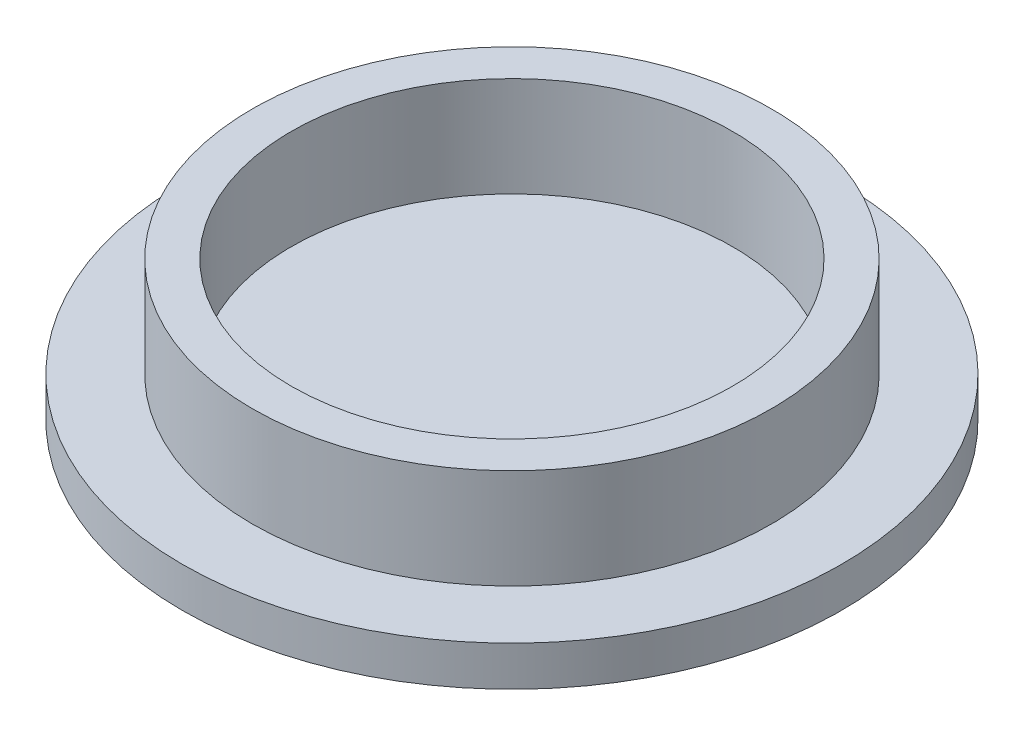
ISO-10303-21;
HEADER;
FILE_DESCRIPTION(('STEP AP214'),'2;1');
FILE_NAME('part.step','',(''),(''),'','','');
FILE_SCHEMA(('AUTOMOTIVE_DESIGN { 1 0 10303 214 1 1 1 1 }'));
ENDSEC;
DATA;
#1=APPLICATION_CONTEXT('core data for automotive mechanical design processes');
#2=APPLICATION_PROTOCOL_DEFINITION('international standard','automotive_design',2000,#1);
#3=PRODUCT_CONTEXT('',#1,'mechanical');
#4=PRODUCT('Part','Part','',(#3));
#5=PRODUCT_RELATED_PRODUCT_CATEGORY('part','',(#4));
#6=PRODUCT_DEFINITION_FORMATION('','',#4);
#7=PRODUCT_DEFINITION_CONTEXT('part definition',#1,'design');
#8=PRODUCT_DEFINITION('design','',#6,#7);
#9=PRODUCT_DEFINITION_SHAPE('','',#8);
#10=(LENGTH_UNIT() NAMED_UNIT(*) SI_UNIT(.MILLI.,.METRE.));
#11=(NAMED_UNIT(*) PLANE_ANGLE_UNIT() SI_UNIT($,.RADIAN.));
#12=(NAMED_UNIT(*) SI_UNIT($,.STERADIAN.) SOLID_ANGLE_UNIT());
#13=UNCERTAINTY_MEASURE_WITH_UNIT(LENGTH_MEASURE(1.E-05),#10,'distance_accuracy_value','');
#14=(GEOMETRIC_REPRESENTATION_CONTEXT(3) GLOBAL_UNCERTAINTY_ASSIGNED_CONTEXT((#13)) GLOBAL_UNIT_ASSIGNED_CONTEXT((#10,
#11,#12)) REPRESENTATION_CONTEXT('',''));
#15=CARTESIAN_POINT('',(0.,0.,0.));
#16=DIRECTION('',(0.,0.,1.));
#17=DIRECTION('',(1.,0.,0.));
#18=AXIS2_PLACEMENT_3D('',#15,#16,#17);
#19=CARTESIAN_POINT('',(0.,2.,0.));
#20=DIRECTION('',(0.,-1.,0.));
#21=DIRECTION('',(0.,0.,-1.));
#22=AXIS2_PLACEMENT_3D('',#19,#20,#21);
#23=CYLINDRICAL_SURFACE('',#22,16.5);
#24=CARTESIAN_POINT('',(0.,2.,0.));
#25=DIRECTION('',(0.,1.,0.));
#26=DIRECTION('',(0.,0.,1.));
#27=AXIS2_PLACEMENT_3D('',#24,#25,#26);
#28=CIRCLE('',#27,16.5);
#29=CARTESIAN_POINT('',(0.,2.,16.5));
#30=VERTEX_POINT('',#29);
#31=EDGE_CURVE('E48',#30,#30,#28,.T.);
#32=ORIENTED_EDGE('',*,*,#31,.F.);
#33=EDGE_LOOP('',(#32));
#34=FACE_BOUND('',#33,.T.);
#35=CARTESIAN_POINT('',(0.,0.,0.));
#36=DIRECTION('',(0.,1.,0.));
#37=DIRECTION('',(0.,0.,1.));
#38=AXIS2_PLACEMENT_3D('',#35,#36,#37);
#39=CIRCLE('',#38,16.5);
#40=CARTESIAN_POINT('',(0.,0.,16.5));
#41=VERTEX_POINT('',#40);
#42=EDGE_CURVE('E53',#41,#41,#39,.T.);
#43=ORIENTED_EDGE('',*,*,#42,.T.);
#44=EDGE_LOOP('',(#43));
#45=FACE_BOUND('',#44,.T.);
#46=ADVANCED_FACE('F41',(#34,#45),#23,.T.);
#47=CARTESIAN_POINT('',(0.,2.,0.));
#48=DIRECTION('',(0.,1.,0.));
#49=DIRECTION('',(0.,0.,1.));
#50=AXIS2_PLACEMENT_3D('',#47,#48,#49);
#51=PLANE('',#50);
#52=CARTESIAN_POINT('',(0.,2.,0.));
#53=DIRECTION('',(0.,1.,0.));
#54=DIRECTION('',(0.,0.,1.));
#55=AXIS2_PLACEMENT_3D('',#52,#53,#54);
#56=CIRCLE('',#55,13.);
#57=CARTESIAN_POINT('',(0.,2.,13.));
#58=VERTEX_POINT('',#57);
#59=EDGE_CURVE('E61',#58,#58,#56,.T.);
#60=ORIENTED_EDGE('',*,*,#59,.F.);
#61=EDGE_LOOP('',(#60));
#62=FACE_BOUND('',#61,.T.);
#63=ORIENTED_EDGE('',*,*,#31,.T.);
#64=EDGE_LOOP('',(#63));
#65=FACE_BOUND('',#64,.T.);
#66=ADVANCED_FACE('F87',(#62,#65),#51,.T.);
#67=CARTESIAN_POINT('',(0.,0.,0.));
#68=DIRECTION('',(0.,1.,0.));
#69=DIRECTION('',(0.,0.,1.));
#70=AXIS2_PLACEMENT_3D('',#67,#68,#69);
#71=PLANE('',#70);
#72=ORIENTED_EDGE('',*,*,#42,.F.);
#73=EDGE_LOOP('',(#72));
#74=FACE_BOUND('',#73,.T.);
#75=ADVANCED_FACE('F78',(#74),#71,.F.);
#76=CARTESIAN_POINT('',(0.,7.,0.));
#77=DIRECTION('',(0.,1.,0.));
#78=DIRECTION('',(0.,0.,1.));
#79=AXIS2_PLACEMENT_3D('',#76,#77,#78);
#80=PLANE('',#79);
#81=CARTESIAN_POINT('',(0.,7.,0.));
#82=DIRECTION('',(0.,1.,0.));
#83=DIRECTION('',(0.,0.,1.));
#84=AXIS2_PLACEMENT_3D('',#81,#82,#83);
#85=CIRCLE('',#84,13.);
#86=CARTESIAN_POINT('',(0.,7.,13.));
#87=VERTEX_POINT('',#86);
#88=EDGE_CURVE('E59',#87,#87,#85,.T.);
#89=ORIENTED_EDGE('',*,*,#88,.T.);
#90=EDGE_LOOP('',(#89));
#91=FACE_BOUND('',#90,.T.);
#92=CARTESIAN_POINT('',(0.,7.,0.));
#93=DIRECTION('',(0.,1.,0.));
#94=DIRECTION('',(0.,0.,1.));
#95=AXIS2_PLACEMENT_3D('',#92,#93,#94);
#96=CIRCLE('',#95,11.05);
#97=CARTESIAN_POINT('',(0.,7.,11.05));
#98=VERTEX_POINT('',#97);
#99=EDGE_CURVE('E65',#98,#98,#96,.T.);
#100=ORIENTED_EDGE('',*,*,#99,.F.);
#101=EDGE_LOOP('',(#100));
#102=FACE_BOUND('',#101,.T.);
#103=ADVANCED_FACE('F75',(#91,#102),#80,.T.);
#104=CARTESIAN_POINT('',(0.,7.,0.));
#105=DIRECTION('',(0.,-1.,0.));
#106=DIRECTION('',(0.,0.,-1.));
#107=AXIS2_PLACEMENT_3D('',#104,#105,#106);
#108=CYLINDRICAL_SURFACE('',#107,13.);
#109=ORIENTED_EDGE('',*,*,#88,.F.);
#110=EDGE_LOOP('',(#109));
#111=FACE_BOUND('',#110,.T.);
#112=ORIENTED_EDGE('',*,*,#59,.T.);
#113=EDGE_LOOP('',(#112));
#114=FACE_BOUND('',#113,.T.);
#115=ADVANCED_FACE('F77',(#111,#114),#108,.T.);
#116=CARTESIAN_POINT('',(0.,7.,0.));
#117=DIRECTION('',(0.,-1.,0.));
#118=DIRECTION('',(0.,0.,-1.));
#119=AXIS2_PLACEMENT_3D('',#116,#117,#118);
#120=CYLINDRICAL_SURFACE('',#119,11.05);
#121=ORIENTED_EDGE('',*,*,#99,.T.);
#122=EDGE_LOOP('',(#121));
#123=FACE_BOUND('',#122,.T.);
#124=CARTESIAN_POINT('',(0.,2.,0.));
#125=DIRECTION('',(0.,1.,0.));
#126=DIRECTION('',(0.,0.,1.));
#127=AXIS2_PLACEMENT_3D('',#124,#125,#126);
#128=CIRCLE('',#127,11.05);
#129=CARTESIAN_POINT('',(0.,2.,11.05));
#130=VERTEX_POINT('',#129);
#131=EDGE_CURVE('E10',#130,#130,#128,.F.);
#132=ORIENTED_EDGE('',*,*,#131,.T.);
#133=EDGE_LOOP('',(#132));
#134=FACE_BOUND('',#133,.T.);
#135=ADVANCED_FACE('F73',(#123,#134),#120,.F.);
#136=ORIENTED_EDGE('',*,*,#131,.F.);
#137=EDGE_LOOP('',(#136));
#138=FACE_BOUND('',#137,.T.);
#139=ADVANCED_FACE('F97',(#138),#51,.T.);
#140=CLOSED_SHELL('',(#46,#66,#75,#103,#115,#135,#139));
#141=MANIFOLD_SOLID_BREP('B2',#140);
#142=ADVANCED_BREP_SHAPE_REPRESENTATION('',(#18,#141),#14);
#143=SHAPE_DEFINITION_REPRESENTATION(#9,#142);
ENDSEC;
END-ISO-10303-21;
